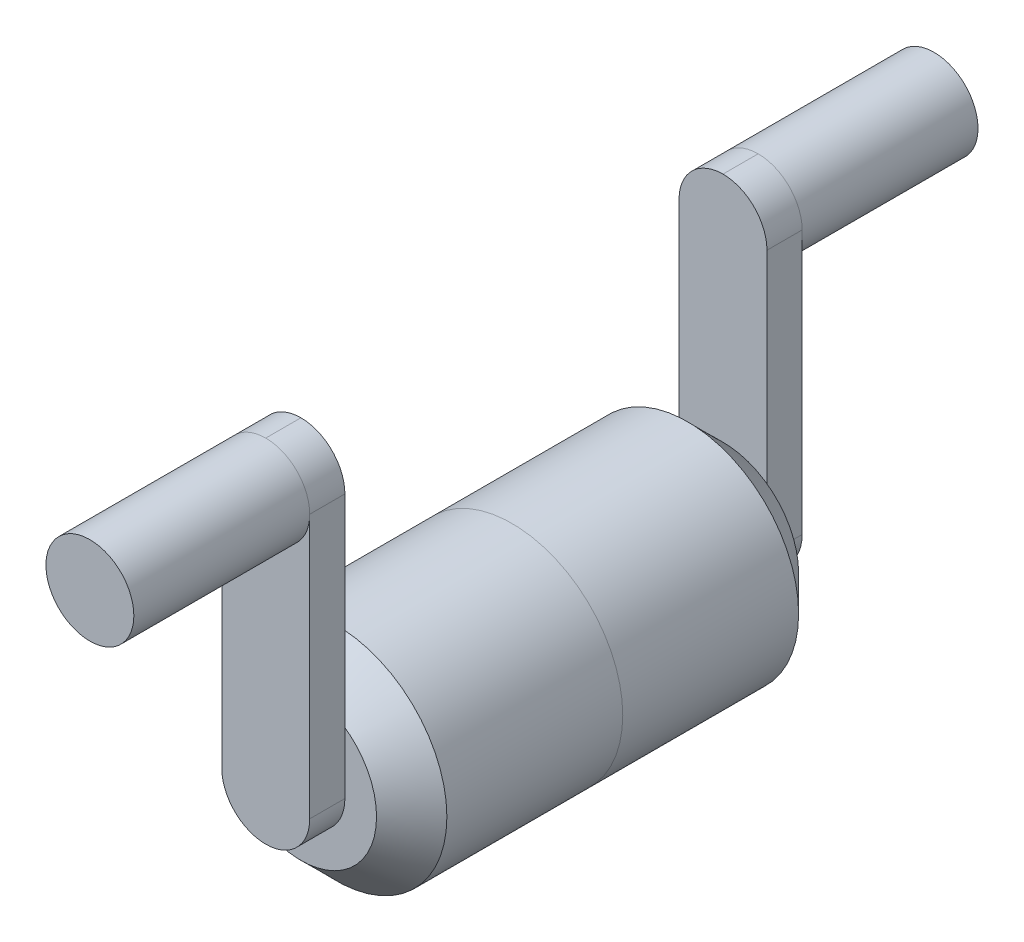
ISO-10303-21;
HEADER;
FILE_DESCRIPTION(('STEP AP214'),'2;1');
FILE_NAME('part.step','',(''),(''),'','','');
FILE_SCHEMA(('AUTOMOTIVE_DESIGN { 1 0 10303 214 1 1 1 1 }'));
ENDSEC;
DATA;
#1=APPLICATION_CONTEXT('core data for automotive mechanical design processes');
#2=APPLICATION_PROTOCOL_DEFINITION('international standard','automotive_design',2000,#1);
#3=PRODUCT_CONTEXT('',#1,'mechanical');
#4=PRODUCT('Part','Part','',(#3));
#5=PRODUCT_RELATED_PRODUCT_CATEGORY('part','',(#4));
#6=PRODUCT_DEFINITION_FORMATION('','',#4);
#7=PRODUCT_DEFINITION_CONTEXT('part definition',#1,'design');
#8=PRODUCT_DEFINITION('design','',#6,#7);
#9=PRODUCT_DEFINITION_SHAPE('','',#8);
#10=(LENGTH_UNIT() NAMED_UNIT(*) SI_UNIT(.MILLI.,.METRE.));
#11=(NAMED_UNIT(*) PLANE_ANGLE_UNIT() SI_UNIT($,.RADIAN.));
#12=(NAMED_UNIT(*) SI_UNIT($,.STERADIAN.) SOLID_ANGLE_UNIT());
#13=UNCERTAINTY_MEASURE_WITH_UNIT(LENGTH_MEASURE(1.E-05),#10,'distance_accuracy_value','');
#14=(GEOMETRIC_REPRESENTATION_CONTEXT(3) GLOBAL_UNCERTAINTY_ASSIGNED_CONTEXT((#13)) GLOBAL_UNIT_ASSIGNED_CONTEXT((#10,
#11,#12)) REPRESENTATION_CONTEXT('',''));
#15=CARTESIAN_POINT('',(0.,0.,0.));
#16=DIRECTION('',(0.,0.,1.));
#17=DIRECTION('',(1.,0.,0.));
#18=AXIS2_PLACEMENT_3D('',#15,#16,#17);
#19=CARTESIAN_POINT('',(0.,0.,-90.));
#20=DIRECTION('',(0.,0.,1.));
#21=DIRECTION('',(-1.,0.,0.));
#22=AXIS2_PLACEMENT_3D('',#19,#20,#21);
#23=CYLINDRICAL_SURFACE('',#22,6.25);
#24=CARTESIAN_POINT('',(0.,0.,-65.));
#25=DIRECTION('',(0.,0.,1.));
#26=DIRECTION('',(1.,0.,0.));
#27=AXIS2_PLACEMENT_3D('',#24,#25,#26);
#28=CIRCLE('',#27,6.25);
#29=CARTESIAN_POINT('',(-6.25,0.,-65.));
#30=VERTEX_POINT('',#29);
#31=CARTESIAN_POINT('',(6.25,0.,-65.));
#32=VERTEX_POINT('',#31);
#33=EDGE_CURVE('E157',#30,#32,#28,.T.);
#34=ORIENTED_EDGE('',*,*,#33,.F.);
#35=CARTESIAN_POINT('',(0.,6.25,-65.));
#36=VERTEX_POINT('',#35);
#37=EDGE_CURVE('E144',#36,#30,#28,.T.);
#38=ORIENTED_EDGE('',*,*,#37,.F.);
#39=EDGE_CURVE('E150',#32,#36,#28,.T.);
#40=ORIENTED_EDGE('',*,*,#39,.F.);
#41=EDGE_LOOP('',(#34,#38,#40));
#42=FACE_BOUND('',#41,.T.);
#43=CARTESIAN_POINT('',(0.,0.,-90.));
#44=DIRECTION('',(0.,0.,1.));
#45=DIRECTION('',(1.,0.,0.));
#46=AXIS2_PLACEMENT_3D('',#43,#44,#45);
#47=CIRCLE('',#46,6.25);
#48=CARTESIAN_POINT('',(6.25,0.,-90.));
#49=VERTEX_POINT('',#48);
#50=EDGE_CURVE('E159',#49,#49,#47,.T.);
#51=ORIENTED_EDGE('',*,*,#50,.T.);
#52=EDGE_LOOP('',(#51));
#53=FACE_BOUND('',#52,.T.);
#54=ADVANCED_FACE('F86',(#42,#53),#23,.T.);
#55=CARTESIAN_POINT('',(0.,0.,-90.));
#56=DIRECTION('',(0.,0.,-1.));
#57=DIRECTION('',(1.,0.,0.));
#58=AXIS2_PLACEMENT_3D('',#55,#56,#57);
#59=PLANE('',#58);
#60=ORIENTED_EDGE('',*,*,#50,.F.);
#61=EDGE_LOOP('',(#60));
#62=FACE_BOUND('',#61,.T.);
#63=ADVANCED_FACE('F205',(#62),#59,.T.);
#64=CARTESIAN_POINT('',(-6.25,0.,-65.));
#65=DIRECTION('',(1.,0.,0.));
#66=DIRECTION('',(0.,1.,0.));
#67=AXIS2_PLACEMENT_3D('',#64,#65,#66);
#68=PLANE('',#67);
#69=DIRECTION('',(0.,-1.,0.));
#70=VECTOR('',#69,1.);
#71=CARTESIAN_POINT('',(-6.25,0.,-60.));
#72=LINE('',#71,#70);
#73=CARTESIAN_POINT('',(-6.25,0.,-60.));
#74=VERTEX_POINT('',#73);
#75=CARTESIAN_POINT('',(-6.25,-37.5,-60.));
#76=VERTEX_POINT('',#75);
#77=EDGE_CURVE('E179',#74,#76,#72,.T.);
#78=ORIENTED_EDGE('',*,*,#77,.F.);
#79=DIRECTION('',(0.,0.,1.));
#80=VECTOR('',#79,1.);
#81=CARTESIAN_POINT('',(-6.25,0.,-60.));
#82=LINE('',#81,#80);
#83=EDGE_CURVE('E169',#30,#74,#82,.T.);
#84=ORIENTED_EDGE('',*,*,#83,.F.);
#85=DIRECTION('',(0.,-1.,0.));
#86=VECTOR('',#85,1.);
#87=CARTESIAN_POINT('',(-6.25,0.,-65.));
#88=LINE('',#87,#86);
#89=CARTESIAN_POINT('',(-6.25,-37.5,-65.));
#90=VERTEX_POINT('',#89);
#91=EDGE_CURVE('E186',#30,#90,#88,.T.);
#92=ORIENTED_EDGE('',*,*,#91,.T.);
#93=DIRECTION('',(0.,0.,1.));
#94=VECTOR('',#93,1.);
#95=CARTESIAN_POINT('',(-6.25,-37.5,-65.));
#96=LINE('',#95,#94);
#97=EDGE_CURVE('E171',#76,#90,#96,.F.);
#98=ORIENTED_EDGE('',*,*,#97,.F.);
#99=EDGE_LOOP('',(#78,#84,#92,#98));
#100=FACE_BOUND('',#99,.T.);
#101=ADVANCED_FACE('F202',(#100),#68,.F.);
#102=CARTESIAN_POINT('',(6.25,0.,-65.));
#103=DIRECTION('',(1.,0.,0.));
#104=DIRECTION('',(0.,1.,0.));
#105=AXIS2_PLACEMENT_3D('',#102,#103,#104);
#106=PLANE('',#105);
#107=DIRECTION('',(0.,-1.,0.));
#108=VECTOR('',#107,1.);
#109=CARTESIAN_POINT('',(6.25,0.,-65.));
#110=LINE('',#109,#108);
#111=CARTESIAN_POINT('',(6.25,-37.5,-65.));
#112=VERTEX_POINT('',#111);
#113=EDGE_CURVE('E184',#32,#112,#110,.T.);
#114=ORIENTED_EDGE('',*,*,#113,.F.);
#115=DIRECTION('',(0.,0.,1.));
#116=VECTOR('',#115,1.);
#117=CARTESIAN_POINT('',(6.25,0.,-65.));
#118=LINE('',#117,#116);
#119=CARTESIAN_POINT('',(6.25,0.,-60.));
#120=VERTEX_POINT('',#119);
#121=EDGE_CURVE('E95',#120,#32,#118,.F.);
#122=ORIENTED_EDGE('',*,*,#121,.F.);
#123=DIRECTION('',(0.,-1.,0.));
#124=VECTOR('',#123,1.);
#125=CARTESIAN_POINT('',(6.25,0.,-60.));
#126=LINE('',#125,#124);
#127=CARTESIAN_POINT('',(6.25,-37.5,-60.));
#128=VERTEX_POINT('',#127);
#129=EDGE_CURVE('E177',#120,#128,#126,.T.);
#130=ORIENTED_EDGE('',*,*,#129,.T.);
#131=DIRECTION('',(0.,0.,1.));
#132=VECTOR('',#131,1.);
#133=CARTESIAN_POINT('',(6.25,-37.5,-60.));
#134=LINE('',#133,#132);
#135=EDGE_CURVE('E13',#112,#128,#134,.T.);
#136=ORIENTED_EDGE('',*,*,#135,.F.);
#137=EDGE_LOOP('',(#114,#122,#130,#136));
#138=FACE_BOUND('',#137,.T.);
#139=ADVANCED_FACE('F192',(#138),#106,.T.);
#140=CARTESIAN_POINT('',(0.,0.,-65.));
#141=DIRECTION('',(0.,0.,-1.));
#142=DIRECTION('',(1.,0.,0.));
#143=AXIS2_PLACEMENT_3D('',#140,#141,#142);
#144=PLANE('',#143);
#145=ORIENTED_EDGE('',*,*,#91,.F.);
#146=ORIENTED_EDGE('',*,*,#33,.T.);
#147=ORIENTED_EDGE('',*,*,#113,.T.);
#148=CARTESIAN_POINT('',(0.,-37.5,-65.));
#149=DIRECTION('',(0.,0.,1.));
#150=DIRECTION('',(1.,0.,0.));
#151=AXIS2_PLACEMENT_3D('',#148,#149,#150);
#152=CIRCLE('',#151,6.25);
#153=CARTESIAN_POINT('',(0.,-43.75,-65.));
#154=VERTEX_POINT('',#153);
#155=EDGE_CURVE('E102',#154,#112,#152,.T.);
#156=ORIENTED_EDGE('',*,*,#155,.F.);
#157=CARTESIAN_POINT('',(0.,-37.5,-65.));
#158=DIRECTION('',(0.,0.,1.));
#159=DIRECTION('',(1.,0.,0.));
#160=AXIS2_PLACEMENT_3D('',#157,#158,#159);
#161=CIRCLE('',#160,6.25);
#162=EDGE_CURVE('E175',#90,#154,#161,.T.);
#163=ORIENTED_EDGE('',*,*,#162,.F.);
#164=EDGE_LOOP('',(#145,#146,#147,#156,#163));
#165=FACE_BOUND('',#164,.T.);
#166=ADVANCED_FACE('F191',(#165),#144,.T.);
#167=CARTESIAN_POINT('',(0.,0.,-60.));
#168=DIRECTION('',(0.,0.,-1.));
#169=DIRECTION('',(1.,0.,0.));
#170=AXIS2_PLACEMENT_3D('',#167,#168,#169);
#171=PLANE('',#170);
#172=CARTESIAN_POINT('',(0.,-37.5,-60.));
#173=DIRECTION('',(0.,0.,1.));
#174=DIRECTION('',(1.,0.,0.));
#175=AXIS2_PLACEMENT_3D('',#172,#173,#174);
#176=CIRCLE('',#175,6.25);
#177=CARTESIAN_POINT('',(0.,-43.75,-60.));
#178=VERTEX_POINT('',#177);
#179=EDGE_CURVE('E165',#128,#178,#176,.F.);
#180=ORIENTED_EDGE('',*,*,#179,.F.);
#181=ORIENTED_EDGE('',*,*,#129,.F.);
#182=CARTESIAN_POINT('',(0.,0.,-60.));
#183=DIRECTION('',(0.,0.,1.));
#184=DIRECTION('',(1.,0.,0.));
#185=AXIS2_PLACEMENT_3D('',#182,#183,#184);
#186=CIRCLE('',#185,6.25);
#187=CARTESIAN_POINT('',(0.,6.25,-60.));
#188=VERTEX_POINT('',#187);
#189=EDGE_CURVE('E155',#188,#120,#186,.F.);
#190=ORIENTED_EDGE('',*,*,#189,.F.);
#191=CARTESIAN_POINT('',(0.,0.,-60.));
#192=DIRECTION('',(0.,0.,1.));
#193=DIRECTION('',(1.,0.,0.));
#194=AXIS2_PLACEMENT_3D('',#191,#192,#193);
#195=CIRCLE('',#194,6.25);
#196=EDGE_CURVE('E146',#74,#188,#195,.F.);
#197=ORIENTED_EDGE('',*,*,#196,.F.);
#198=ORIENTED_EDGE('',*,*,#77,.T.);
#199=CARTESIAN_POINT('',(0.,-37.5,-60.));
#200=DIRECTION('',(0.,0.,1.));
#201=DIRECTION('',(1.,0.,0.));
#202=AXIS2_PLACEMENT_3D('',#199,#200,#201);
#203=CIRCLE('',#202,6.25);
#204=EDGE_CURVE('E167',#178,#76,#203,.F.);
#205=ORIENTED_EDGE('',*,*,#204,.F.);
#206=EDGE_LOOP('',(#180,#181,#190,#197,#198,#205));
#207=FACE_BOUND('',#206,.T.);
#208=ADVANCED_FACE('F196',(#207),#171,.F.);
#209=CARTESIAN_POINT('',(0.,-37.5,-65.));
#210=DIRECTION('',(0.,0.,-1.));
#211=DIRECTION('',(1.,0.,0.));
#212=AXIS2_PLACEMENT_3D('',#209,#210,#211);
#213=CYLINDRICAL_SURFACE('',#212,6.25);
#214=ORIENTED_EDGE('',*,*,#135,.T.);
#215=ORIENTED_EDGE('',*,*,#179,.T.);
#216=DIRECTION('',(0.,0.,1.));
#217=VECTOR('',#216,1.);
#218=CARTESIAN_POINT('',(0.,-43.75,-65.));
#219=LINE('',#218,#217);
#220=EDGE_CURVE('E107',#178,#154,#219,.F.);
#221=ORIENTED_EDGE('',*,*,#220,.T.);
#222=ORIENTED_EDGE('',*,*,#155,.T.);
#223=EDGE_LOOP('',(#214,#215,#221,#222));
#224=FACE_BOUND('',#223,.T.);
#225=ADVANCED_FACE('F193',(#224),#213,.T.);
#226=CARTESIAN_POINT('',(0.,-37.5,-65.));
#227=DIRECTION('',(0.,0.,1.));
#228=DIRECTION('',(-1.,0.,0.));
#229=AXIS2_PLACEMENT_3D('',#226,#227,#228);
#230=CYLINDRICAL_SURFACE('',#229,6.25);
#231=ORIENTED_EDGE('',*,*,#162,.T.);
#232=ORIENTED_EDGE('',*,*,#220,.F.);
#233=ORIENTED_EDGE('',*,*,#204,.T.);
#234=ORIENTED_EDGE('',*,*,#97,.T.);
#235=EDGE_LOOP('',(#231,#232,#233,#234));
#236=FACE_BOUND('',#235,.T.);
#237=ADVANCED_FACE('F200',(#236),#230,.T.);
#238=CARTESIAN_POINT('',(0.,0.,-65.));
#239=DIRECTION('',(0.,0.,1.));
#240=DIRECTION('',(-1.,0.,0.));
#241=AXIS2_PLACEMENT_3D('',#238,#239,#240);
#242=CYLINDRICAL_SURFACE('',#241,6.25);
#243=DIRECTION('',(0.,0.,1.));
#244=VECTOR('',#243,1.);
#245=CARTESIAN_POINT('',(0.,6.25,-65.));
#246=LINE('',#245,#244);
#247=EDGE_CURVE('E90',#36,#188,#246,.T.);
#248=ORIENTED_EDGE('',*,*,#247,.T.);
#249=ORIENTED_EDGE('',*,*,#189,.T.);
#250=ORIENTED_EDGE('',*,*,#121,.T.);
#251=ORIENTED_EDGE('',*,*,#39,.T.);
#252=EDGE_LOOP('',(#248,#249,#250,#251));
#253=FACE_BOUND('',#252,.T.);
#254=ADVANCED_FACE('F88',(#253),#242,.T.);
#255=CARTESIAN_POINT('',(0.,0.,-65.));
#256=DIRECTION('',(0.,0.,-1.));
#257=DIRECTION('',(1.,0.,0.));
#258=AXIS2_PLACEMENT_3D('',#255,#256,#257);
#259=CYLINDRICAL_SURFACE('',#258,6.25);
#260=ORIENTED_EDGE('',*,*,#37,.T.);
#261=ORIENTED_EDGE('',*,*,#83,.T.);
#262=ORIENTED_EDGE('',*,*,#196,.T.);
#263=ORIENTED_EDGE('',*,*,#247,.F.);
#264=EDGE_LOOP('',(#260,#261,#262,#263));
#265=FACE_BOUND('',#264,.T.);
#266=ADVANCED_FACE('F141',(#265),#259,.T.);
#267=CLOSED_SHELL('',(#54,#63,#101,#139,#166,#208,#225,#237,#254,#266));
#268=MANIFOLD_SOLID_BREP('B2',#267);
#269=CARTESIAN_POINT('',(0.,-37.5,-30.));
#270=DIRECTION('',(0.,0.,-1.));
#271=DIRECTION('',(1.,0.,0.));
#272=AXIS2_PLACEMENT_3D('',#269,#270,#271);
#273=CYLINDRICAL_SURFACE('',#272,15.75);
#274=CARTESIAN_POINT('',(0.,-37.5,-55.));
#275=DIRECTION('',(0.,0.,1.));
#276=DIRECTION('',(1.,0.,0.));
#277=AXIS2_PLACEMENT_3D('',#274,#275,#276);
#278=CIRCLE('',#277,15.75);
#279=CARTESIAN_POINT('',(15.75,-37.5,-55.));
#280=VERTEX_POINT('',#279);
#281=EDGE_CURVE('E85',#280,#280,#278,.F.);
#282=ORIENTED_EDGE('',*,*,#281,.F.);
#283=EDGE_LOOP('',(#282));
#284=FACE_BOUND('',#283,.T.);
#285=CARTESIAN_POINT('',(0.,-37.5,-30.));
#286=DIRECTION('',(0.,0.,1.));
#287=DIRECTION('',(1.,0.,0.));
#288=AXIS2_PLACEMENT_3D('',#285,#286,#287);
#289=CIRCLE('',#288,15.75);
#290=CARTESIAN_POINT('',(15.75,-37.5,-30.));
#291=VERTEX_POINT('',#290);
#292=EDGE_CURVE('E357',#291,#291,#289,.T.);
#293=ORIENTED_EDGE('',*,*,#292,.F.);
#294=EDGE_LOOP('',(#293));
#295=FACE_BOUND('',#294,.T.);
#296=ADVANCED_FACE('F344',(#284,#295),#273,.T.);
#297=CARTESIAN_POINT('',(0.,0.,-60.));
#298=DIRECTION('',(0.,0.,-1.));
#299=DIRECTION('',(1.,0.,0.));
#300=AXIS2_PLACEMENT_3D('',#297,#298,#299);
#301=PLANE('',#300);
#302=CARTESIAN_POINT('',(0.,-37.5,-60.));
#303=DIRECTION('',(0.,0.,1.));
#304=DIRECTION('',(1.,0.,0.));
#305=AXIS2_PLACEMENT_3D('',#302,#303,#304);
#306=CIRCLE('',#305,10.75);
#307=CARTESIAN_POINT('',(10.75,-37.5,-60.));
#308=VERTEX_POINT('',#307);
#309=EDGE_CURVE('E352',#308,#308,#306,.T.);
#310=ORIENTED_EDGE('',*,*,#309,.F.);
#311=EDGE_LOOP('',(#310));
#312=FACE_BOUND('',#311,.T.);
#313=ADVANCED_FACE('F368',(#312),#301,.T.);
#314=CARTESIAN_POINT('',(0.,0.,-30.));
#315=DIRECTION('',(0.,0.,-1.));
#316=DIRECTION('',(1.,0.,0.));
#317=AXIS2_PLACEMENT_3D('',#314,#315,#316);
#318=PLANE('',#317);
#319=ORIENTED_EDGE('',*,*,#292,.T.);
#320=EDGE_LOOP('',(#319));
#321=FACE_BOUND('',#320,.T.);
#322=ADVANCED_FACE('F365',(#321),#318,.F.);
#323=CARTESIAN_POINT('',(0.,-37.5,-60.));
#324=DIRECTION('',(0.,0.,1.));
#325=DIRECTION('',(-1.,0.,0.));
#326=AXIS2_PLACEMENT_3D('',#323,#324,#325);
#327=CONICAL_SURFACE('',#326,10.75,0.785398163397447);
#328=ORIENTED_EDGE('',*,*,#281,.T.);
#329=EDGE_LOOP('',(#328));
#330=FACE_BOUND('',#329,.T.);
#331=ORIENTED_EDGE('',*,*,#309,.T.);
#332=EDGE_LOOP('',(#331));
#333=FACE_BOUND('',#332,.T.);
#334=ADVANCED_FACE('F346',(#330,#333),#327,.T.);
#335=CLOSED_SHELL('',(#296,#313,#322,#334));
#336=MANIFOLD_SOLID_BREP('B7',#335);
#337=CARTESIAN_POINT('',(0.,-37.5,-30.));
#338=DIRECTION('',(0.,0.,1.));
#339=DIRECTION('',(1.,0.,0.));
#340=AXIS2_PLACEMENT_3D('',#337,#338,#339);
#341=CYLINDRICAL_SURFACE('',#340,15.75);
#342=CARTESIAN_POINT('',(0.,-37.5,-5.00000000000002));
#343=DIRECTION('',(0.,0.,1.));
#344=DIRECTION('',(1.,0.,0.));
#345=AXIS2_PLACEMENT_3D('',#342,#343,#344);
#346=CIRCLE('',#345,15.75);
#347=CARTESIAN_POINT('',(15.75,-37.5,-5.00000000000002));
#348=VERTEX_POINT('',#347);
#349=EDGE_CURVE('E343',#348,#348,#346,.F.);
#350=ORIENTED_EDGE('',*,*,#349,.T.);
#351=EDGE_LOOP('',(#350));
#352=FACE_BOUND('',#351,.T.);
#353=CARTESIAN_POINT('',(0.,-37.5,-30.));
#354=DIRECTION('',(0.,0.,1.));
#355=DIRECTION('',(1.,0.,0.));
#356=AXIS2_PLACEMENT_3D('',#353,#354,#355);
#357=CIRCLE('',#356,15.75);
#358=CARTESIAN_POINT('',(15.75,-37.5,-30.));
#359=VERTEX_POINT('',#358);
#360=EDGE_CURVE('E447',#359,#359,#357,.T.);
#361=ORIENTED_EDGE('',*,*,#360,.T.);
#362=EDGE_LOOP('',(#361));
#363=FACE_BOUND('',#362,.T.);
#364=ADVANCED_FACE('F435',(#352,#363),#341,.T.);
#365=CARTESIAN_POINT('',(0.,0.,0.));
#366=DIRECTION('',(0.,0.,1.));
#367=DIRECTION('',(1.,0.,0.));
#368=AXIS2_PLACEMENT_3D('',#365,#366,#367);
#369=PLANE('',#368);
#370=CARTESIAN_POINT('',(0.,-37.5,0.));
#371=DIRECTION('',(0.,0.,1.));
#372=DIRECTION('',(1.,0.,0.));
#373=AXIS2_PLACEMENT_3D('',#370,#371,#372);
#374=CIRCLE('',#373,10.75);
#375=CARTESIAN_POINT('',(10.75,-37.5,0.));
#376=VERTEX_POINT('',#375);
#377=EDGE_CURVE('E443',#376,#376,#374,.T.);
#378=ORIENTED_EDGE('',*,*,#377,.T.);
#379=EDGE_LOOP('',(#378));
#380=FACE_BOUND('',#379,.T.);
#381=ADVANCED_FACE('F457',(#380),#369,.T.);
#382=CARTESIAN_POINT('',(0.,0.,-30.));
#383=DIRECTION('',(0.,0.,1.));
#384=DIRECTION('',(1.,0.,0.));
#385=AXIS2_PLACEMENT_3D('',#382,#383,#384);
#386=PLANE('',#385);
#387=ORIENTED_EDGE('',*,*,#360,.F.);
#388=EDGE_LOOP('',(#387));
#389=FACE_BOUND('',#388,.T.);
#390=ADVANCED_FACE('F455',(#389),#386,.F.);
#391=CARTESIAN_POINT('',(0.,-37.5,0.));
#392=DIRECTION('',(0.,0.,-1.));
#393=DIRECTION('',(-1.,0.,0.));
#394=AXIS2_PLACEMENT_3D('',#391,#392,#393);
#395=CONICAL_SURFACE('',#394,10.75,0.785398163397447);
#396=ORIENTED_EDGE('',*,*,#349,.F.);
#397=EDGE_LOOP('',(#396));
#398=FACE_BOUND('',#397,.T.);
#399=ORIENTED_EDGE('',*,*,#377,.F.);
#400=EDGE_LOOP('',(#399));
#401=FACE_BOUND('',#400,.T.);
#402=ADVANCED_FACE('F438',(#398,#401),#395,.T.);
#403=CLOSED_SHELL('',(#364,#381,#390,#402));
#404=MANIFOLD_SOLID_BREP('B80',#403);
#405=CARTESIAN_POINT('',(0.,0.,30.));
#406=DIRECTION('',(0.,0.,-1.));
#407=DIRECTION('',(-1.,0.,0.));
#408=AXIS2_PLACEMENT_3D('',#405,#406,#407);
#409=CYLINDRICAL_SURFACE('',#408,6.25);
#410=CARTESIAN_POINT('',(0.,0.,5.));
#411=DIRECTION('',(0.,0.,1.));
#412=DIRECTION('',(1.,0.,0.));
#413=AXIS2_PLACEMENT_3D('',#410,#411,#412);
#414=CIRCLE('',#413,6.25);
#415=CARTESIAN_POINT('',(-6.25,0.,5.));
#416=VERTEX_POINT('',#415);
#417=CARTESIAN_POINT('',(6.25,0.,5.));
#418=VERTEX_POINT('',#417);
#419=EDGE_CURVE('E577',#416,#418,#414,.T.);
#420=ORIENTED_EDGE('',*,*,#419,.T.);
#421=CARTESIAN_POINT('',(0.,6.25,5.));
#422=VERTEX_POINT('',#421);
#423=EDGE_CURVE('E571',#418,#422,#414,.T.);
#424=ORIENTED_EDGE('',*,*,#423,.T.);
#425=EDGE_CURVE('E575',#422,#416,#414,.T.);
#426=ORIENTED_EDGE('',*,*,#425,.T.);
#427=EDGE_LOOP('',(#420,#424,#426));
#428=FACE_BOUND('',#427,.T.);
#429=CARTESIAN_POINT('',(0.,0.,30.));
#430=DIRECTION('',(0.,0.,1.));
#431=DIRECTION('',(1.,0.,0.));
#432=AXIS2_PLACEMENT_3D('',#429,#430,#431);
#433=CIRCLE('',#432,6.25);
#434=CARTESIAN_POINT('',(6.25,0.,30.));
#435=VERTEX_POINT('',#434);
#436=EDGE_CURVE('E589',#435,#435,#433,.T.);
#437=ORIENTED_EDGE('',*,*,#436,.F.);
#438=EDGE_LOOP('',(#437));
#439=FACE_BOUND('',#438,.T.);
#440=ADVANCED_FACE('F517',(#428,#439),#409,.T.);
#441=CARTESIAN_POINT('',(0.,0.,30.));
#442=DIRECTION('',(0.,0.,1.));
#443=DIRECTION('',(1.,0.,0.));
#444=AXIS2_PLACEMENT_3D('',#441,#442,#443);
#445=PLANE('',#444);
#446=ORIENTED_EDGE('',*,*,#436,.T.);
#447=EDGE_LOOP('',(#446));
#448=FACE_BOUND('',#447,.T.);
#449=ADVANCED_FACE('F643',(#448),#445,.T.);
#450=CARTESIAN_POINT('',(-6.25,0.,5.));
#451=DIRECTION('',(1.,0.,0.));
#452=DIRECTION('',(0.,1.,0.));
#453=AXIS2_PLACEMENT_3D('',#450,#451,#452);
#454=PLANE('',#453);
#455=DIRECTION('',(0.,-1.,0.));
#456=VECTOR('',#455,1.);
#457=CARTESIAN_POINT('',(-6.25,0.,0.));
#458=LINE('',#457,#456);
#459=CARTESIAN_POINT('',(-6.25,0.,0.));
#460=VERTEX_POINT('',#459);
#461=CARTESIAN_POINT('',(-6.25,-37.5,0.));
#462=VERTEX_POINT('',#461);
#463=EDGE_CURVE('E612',#460,#462,#458,.T.);
#464=ORIENTED_EDGE('',*,*,#463,.T.);
#465=DIRECTION('',(0.,0.,-1.));
#466=VECTOR('',#465,1.);
#467=CARTESIAN_POINT('',(-6.25,-37.5,5.));
#468=LINE('',#467,#466);
#469=CARTESIAN_POINT('',(-6.25,-37.5,5.));
#470=VERTEX_POINT('',#469);
#471=EDGE_CURVE('E601',#462,#470,#468,.F.);
#472=ORIENTED_EDGE('',*,*,#471,.T.);
#473=DIRECTION('',(0.,-1.,0.));
#474=VECTOR('',#473,1.);
#475=CARTESIAN_POINT('',(-6.25,0.,5.));
#476=LINE('',#475,#474);
#477=EDGE_CURVE('E620',#416,#470,#476,.T.);
#478=ORIENTED_EDGE('',*,*,#477,.F.);
#479=DIRECTION('',(0.,0.,-1.));
#480=VECTOR('',#479,1.);
#481=CARTESIAN_POINT('',(-6.25,0.,0.));
#482=LINE('',#481,#480);
#483=EDGE_CURVE('E588',#416,#460,#482,.T.);
#484=ORIENTED_EDGE('',*,*,#483,.T.);
#485=EDGE_LOOP('',(#464,#472,#478,#484));
#486=FACE_BOUND('',#485,.T.);
#487=ADVANCED_FACE('F631',(#486),#454,.F.);
#488=CARTESIAN_POINT('',(6.25,0.,5.));
#489=DIRECTION('',(1.,0.,0.));
#490=DIRECTION('',(0.,1.,0.));
#491=AXIS2_PLACEMENT_3D('',#488,#489,#490);
#492=PLANE('',#491);
#493=DIRECTION('',(0.,-1.,0.));
#494=VECTOR('',#493,1.);
#495=CARTESIAN_POINT('',(6.25,0.,5.));
#496=LINE('',#495,#494);
#497=CARTESIAN_POINT('',(6.25,-37.5,5.));
#498=VERTEX_POINT('',#497);
#499=EDGE_CURVE('E618',#418,#498,#496,.T.);
#500=ORIENTED_EDGE('',*,*,#499,.T.);
#501=DIRECTION('',(0.,0.,-1.));
#502=VECTOR('',#501,1.);
#503=CARTESIAN_POINT('',(6.25,-37.5,0.));
#504=LINE('',#503,#502);
#505=CARTESIAN_POINT('',(6.25,-37.5,0.));
#506=VERTEX_POINT('',#505);
#507=EDGE_CURVE('E433',#498,#506,#504,.T.);
#508=ORIENTED_EDGE('',*,*,#507,.T.);
#509=DIRECTION('',(0.,-1.,0.));
#510=VECTOR('',#509,1.);
#511=CARTESIAN_POINT('',(6.25,0.,0.));
#512=LINE('',#511,#510);
#513=CARTESIAN_POINT('',(6.25,0.,0.));
#514=VERTEX_POINT('',#513);
#515=EDGE_CURVE('E607',#514,#506,#512,.T.);
#516=ORIENTED_EDGE('',*,*,#515,.F.);
#517=DIRECTION('',(0.,0.,-1.));
#518=VECTOR('',#517,1.);
#519=CARTESIAN_POINT('',(6.25,0.,5.));
#520=LINE('',#519,#518);
#521=EDGE_CURVE('E526',#514,#418,#520,.F.);
#522=ORIENTED_EDGE('',*,*,#521,.T.);
#523=EDGE_LOOP('',(#500,#508,#516,#522));
#524=FACE_BOUND('',#523,.T.);
#525=ADVANCED_FACE('F624',(#524),#492,.T.);
#526=CARTESIAN_POINT('',(0.,0.,5.));
#527=DIRECTION('',(0.,0.,1.));
#528=DIRECTION('',(1.,0.,0.));
#529=AXIS2_PLACEMENT_3D('',#526,#527,#528);
#530=PLANE('',#529);
#531=ORIENTED_EDGE('',*,*,#477,.T.);
#532=CARTESIAN_POINT('',(0.,-37.5,5.));
#533=DIRECTION('',(0.,0.,1.));
#534=DIRECTION('',(1.,0.,0.));
#535=AXIS2_PLACEMENT_3D('',#532,#533,#534);
#536=CIRCLE('',#535,6.25);
#537=CARTESIAN_POINT('',(0.,-43.75,5.));
#538=VERTEX_POINT('',#537);
#539=EDGE_CURVE('E539',#470,#538,#536,.T.);
#540=ORIENTED_EDGE('',*,*,#539,.T.);
#541=CARTESIAN_POINT('',(0.,-37.5,5.));
#542=DIRECTION('',(0.,0.,1.));
#543=DIRECTION('',(1.,0.,0.));
#544=AXIS2_PLACEMENT_3D('',#541,#542,#543);
#545=CIRCLE('',#544,6.25);
#546=EDGE_CURVE('E534',#538,#498,#545,.T.);
#547=ORIENTED_EDGE('',*,*,#546,.T.);
#548=ORIENTED_EDGE('',*,*,#499,.F.);
#549=ORIENTED_EDGE('',*,*,#419,.F.);
#550=EDGE_LOOP('',(#531,#540,#547,#548,#549));
#551=FACE_BOUND('',#550,.T.);
#552=ADVANCED_FACE('F651',(#551),#530,.T.);
#553=CARTESIAN_POINT('',(0.,0.,0.));
#554=DIRECTION('',(0.,0.,1.));
#555=DIRECTION('',(1.,0.,0.));
#556=AXIS2_PLACEMENT_3D('',#553,#554,#555);
#557=PLANE('',#556);
#558=CARTESIAN_POINT('',(0.,-37.5,0.));
#559=DIRECTION('',(0.,0.,1.));
#560=DIRECTION('',(1.,0.,0.));
#561=AXIS2_PLACEMENT_3D('',#558,#559,#560);
#562=CIRCLE('',#561,6.25);
#563=CARTESIAN_POINT('',(0.,-43.75,0.));
#564=VERTEX_POINT('',#563);
#565=EDGE_CURVE('E596',#506,#564,#562,.F.);
#566=ORIENTED_EDGE('',*,*,#565,.T.);
#567=CARTESIAN_POINT('',(0.,-37.5,0.));
#568=DIRECTION('',(0.,0.,1.));
#569=DIRECTION('',(1.,0.,0.));
#570=AXIS2_PLACEMENT_3D('',#567,#568,#569);
#571=CIRCLE('',#570,6.25);
#572=EDGE_CURVE('E598',#564,#462,#571,.F.);
#573=ORIENTED_EDGE('',*,*,#572,.T.);
#574=ORIENTED_EDGE('',*,*,#463,.F.);
#575=CARTESIAN_POINT('',(0.,0.,0.));
#576=DIRECTION('',(0.,0.,1.));
#577=DIRECTION('',(1.,0.,0.));
#578=AXIS2_PLACEMENT_3D('',#575,#576,#577);
#579=CIRCLE('',#578,6.25);
#580=CARTESIAN_POINT('',(0.,6.25,0.));
#581=VERTEX_POINT('',#580);
#582=EDGE_CURVE('E594',#460,#581,#579,.F.);
#583=ORIENTED_EDGE('',*,*,#582,.T.);
#584=CARTESIAN_POINT('',(0.,0.,0.));
#585=DIRECTION('',(0.,0.,1.));
#586=DIRECTION('',(1.,0.,0.));
#587=AXIS2_PLACEMENT_3D('',#584,#585,#586);
#588=CIRCLE('',#587,6.25);
#589=EDGE_CURVE('E580',#581,#514,#588,.F.);
#590=ORIENTED_EDGE('',*,*,#589,.T.);
#591=ORIENTED_EDGE('',*,*,#515,.T.);
#592=EDGE_LOOP('',(#566,#573,#574,#583,#590,#591));
#593=FACE_BOUND('',#592,.T.);
#594=ADVANCED_FACE('F627',(#593),#557,.F.);
#595=CARTESIAN_POINT('',(0.,-37.5,5.));
#596=DIRECTION('',(0.,0.,1.));
#597=DIRECTION('',(1.,0.,0.));
#598=AXIS2_PLACEMENT_3D('',#595,#596,#597);
#599=CYLINDRICAL_SURFACE('',#598,6.25);
#600=ORIENTED_EDGE('',*,*,#507,.F.);
#601=ORIENTED_EDGE('',*,*,#546,.F.);
#602=DIRECTION('',(0.,0.,-1.));
#603=VECTOR('',#602,1.);
#604=CARTESIAN_POINT('',(0.,-43.75,5.));
#605=LINE('',#604,#603);
#606=EDGE_CURVE('E585',#564,#538,#605,.F.);
#607=ORIENTED_EDGE('',*,*,#606,.F.);
#608=ORIENTED_EDGE('',*,*,#565,.F.);
#609=EDGE_LOOP('',(#600,#601,#607,#608));
#610=FACE_BOUND('',#609,.T.);
#611=ADVANCED_FACE('F626',(#610),#599,.T.);
#612=CARTESIAN_POINT('',(0.,-37.5,5.));
#613=DIRECTION('',(0.,0.,-1.));
#614=DIRECTION('',(-1.,0.,0.));
#615=AXIS2_PLACEMENT_3D('',#612,#613,#614);
#616=CYLINDRICAL_SURFACE('',#615,6.25);
#617=ORIENTED_EDGE('',*,*,#539,.F.);
#618=ORIENTED_EDGE('',*,*,#471,.F.);
#619=ORIENTED_EDGE('',*,*,#572,.F.);
#620=ORIENTED_EDGE('',*,*,#606,.T.);
#621=EDGE_LOOP('',(#617,#618,#619,#620));
#622=FACE_BOUND('',#621,.T.);
#623=ADVANCED_FACE('F633',(#622),#616,.T.);
#624=CARTESIAN_POINT('',(0.,0.,5.));
#625=DIRECTION('',(0.,0.,-1.));
#626=DIRECTION('',(-1.,0.,0.));
#627=AXIS2_PLACEMENT_3D('',#624,#625,#626);
#628=CYLINDRICAL_SURFACE('',#627,6.25);
#629=DIRECTION('',(0.,0.,-1.));
#630=VECTOR('',#629,1.);
#631=CARTESIAN_POINT('',(0.,6.25,5.));
#632=LINE('',#631,#630);
#633=EDGE_CURVE('E521',#422,#581,#632,.T.);
#634=ORIENTED_EDGE('',*,*,#633,.F.);
#635=ORIENTED_EDGE('',*,*,#423,.F.);
#636=ORIENTED_EDGE('',*,*,#521,.F.);
#637=ORIENTED_EDGE('',*,*,#589,.F.);
#638=EDGE_LOOP('',(#634,#635,#636,#637));
#639=FACE_BOUND('',#638,.T.);
#640=ADVANCED_FACE('F519',(#639),#628,.T.);
#641=CARTESIAN_POINT('',(0.,0.,5.));
#642=DIRECTION('',(0.,0.,1.));
#643=DIRECTION('',(1.,0.,0.));
#644=AXIS2_PLACEMENT_3D('',#641,#642,#643);
#645=CYLINDRICAL_SURFACE('',#644,6.25);
#646=ORIENTED_EDGE('',*,*,#425,.F.);
#647=ORIENTED_EDGE('',*,*,#633,.T.);
#648=ORIENTED_EDGE('',*,*,#582,.F.);
#649=ORIENTED_EDGE('',*,*,#483,.F.);
#650=EDGE_LOOP('',(#646,#647,#648,#649));
#651=FACE_BOUND('',#650,.T.);
#652=ADVANCED_FACE('F586',(#651),#645,.T.);
#653=CLOSED_SHELL('',(#440,#449,#487,#525,#552,#594,#611,#623,#640,#652));
#654=MANIFOLD_SOLID_BREP('B338',#653);
#655=ADVANCED_BREP_SHAPE_REPRESENTATION('',(#18,#268,#336,#404,#654),#14);
#656=SHAPE_DEFINITION_REPRESENTATION(#9,#655);
ENDSEC;
END-ISO-10303-21;
